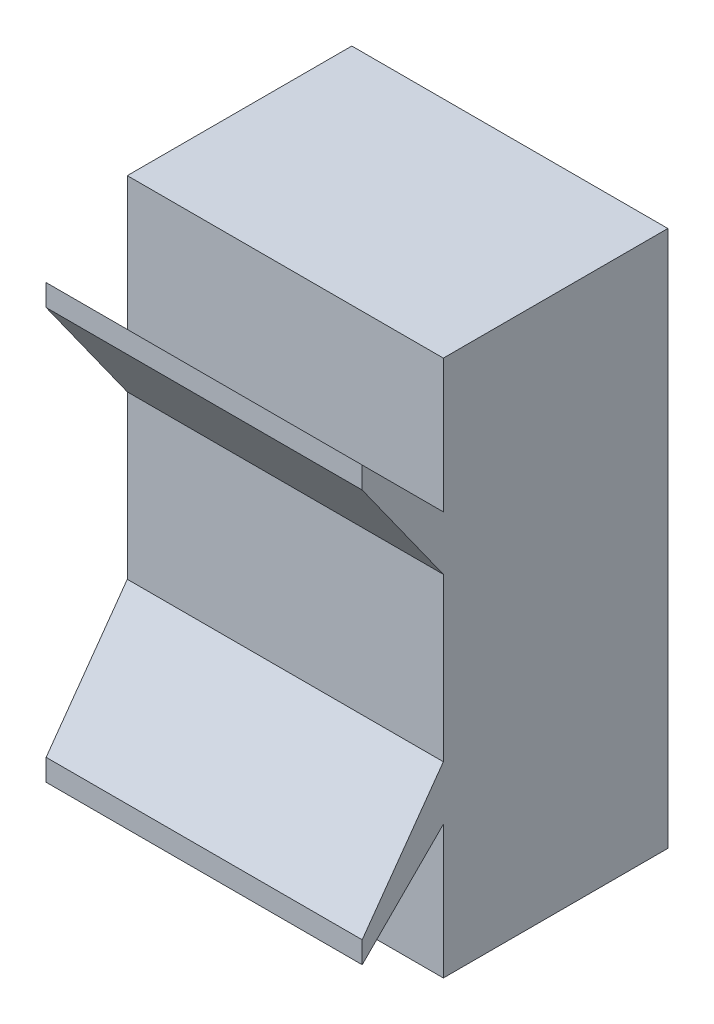
ISO-10303-21;
HEADER;
FILE_DESCRIPTION(('STEP AP214'),'2;1');
FILE_NAME('part.step','',(''),(''),'','','');
FILE_SCHEMA(('AUTOMOTIVE_DESIGN { 1 0 10303 214 1 1 1 1 }'));
ENDSEC;
DATA;
#1=APPLICATION_CONTEXT('core data for automotive mechanical design processes');
#2=APPLICATION_PROTOCOL_DEFINITION('international standard','automotive_design',2000,#1);
#3=PRODUCT_CONTEXT('',#1,'mechanical');
#4=PRODUCT('Part','Part','',(#3));
#5=PRODUCT_RELATED_PRODUCT_CATEGORY('part','',(#4));
#6=PRODUCT_DEFINITION_FORMATION('','',#4);
#7=PRODUCT_DEFINITION_CONTEXT('part definition',#1,'design');
#8=PRODUCT_DEFINITION('design','',#6,#7);
#9=PRODUCT_DEFINITION_SHAPE('','',#8);
#10=(LENGTH_UNIT() NAMED_UNIT(*) SI_UNIT(.MILLI.,.METRE.));
#11=(NAMED_UNIT(*) PLANE_ANGLE_UNIT() SI_UNIT($,.RADIAN.));
#12=(NAMED_UNIT(*) SI_UNIT($,.STERADIAN.) SOLID_ANGLE_UNIT());
#13=UNCERTAINTY_MEASURE_WITH_UNIT(LENGTH_MEASURE(1.E-05),#10,'distance_accuracy_value','');
#14=(GEOMETRIC_REPRESENTATION_CONTEXT(3) GLOBAL_UNCERTAINTY_ASSIGNED_CONTEXT((#13)) GLOBAL_UNIT_ASSIGNED_CONTEXT((#10,
#11,#12)) REPRESENTATION_CONTEXT('',''));
#15=CARTESIAN_POINT('',(0.,0.,0.));
#16=DIRECTION('',(0.,0.,1.));
#17=DIRECTION('',(1.,0.,0.));
#18=AXIS2_PLACEMENT_3D('',#15,#16,#17);
#19=CARTESIAN_POINT('',(-0.986425732328459,14.3199946452465,4.15));
#20=DIRECTION('',(0.,0.,1.));
#21=DIRECTION('',(1.,0.,0.));
#22=AXIS2_PLACEMENT_3D('',#19,#20,#21);
#23=PLANE('',#22);
#24=DIRECTION('',(1.,0.,0.));
#25=VECTOR('',#24,1.);
#26=CARTESIAN_POINT('',(5.97685012076511,27.8199946452465,4.15));
#27=LINE('',#26,#25);
#28=CARTESIAN_POINT('',(8.89232606818775,27.8199946452465,4.15));
#29=VERTEX_POINT('',#28);
#30=CARTESIAN_POINT('',(14.7348224671553,27.8199946452465,4.15));
#31=VERTEX_POINT('',#30);
#32=EDGE_CURVE('E55',#29,#31,#27,.T.);
#33=ORIENTED_EDGE('',*,*,#32,.F.);
#34=DIRECTION('',(0.,-1.,0.));
#35=VECTOR('',#34,1.);
#36=CARTESIAN_POINT('',(8.89232606818775,31.2817879589053,4.15));
#37=LINE('',#36,#35);
#38=CARTESIAN_POINT('',(8.89232606818776,24.8199946452465,4.15));
#39=VERTEX_POINT('',#38);
#40=EDGE_CURVE('E135',#29,#39,#37,.T.);
#41=ORIENTED_EDGE('',*,*,#40,.T.);
#42=DIRECTION('',(1.,0.,0.));
#43=VECTOR('',#42,1.);
#44=CARTESIAN_POINT('',(5.97685012076511,24.8199946452465,4.15));
#45=LINE('',#44,#43);
#46=CARTESIAN_POINT('',(14.7348224671553,24.8199946452465,4.15));
#47=VERTEX_POINT('',#46);
#48=EDGE_CURVE('E168',#39,#47,#45,.T.);
#49=ORIENTED_EDGE('',*,*,#48,.T.);
#50=DIRECTION('',(0.,1.,0.));
#51=VECTOR('',#50,1.);
#52=CARTESIAN_POINT('',(14.7348224671553,21.3582013315878,4.15));
#53=LINE('',#52,#51);
#54=EDGE_CURVE('E46',#47,#31,#53,.T.);
#55=ORIENTED_EDGE('',*,*,#54,.T.);
#56=EDGE_LOOP('',(#33,#41,#49,#55));
#57=FACE_BOUND('',#56,.T.);
#58=ADVANCED_FACE('F37',(#57),#23,.T.);
#59=DIRECTION('',(1.,0.,0.));
#60=VECTOR('',#59,1.);
#61=CARTESIAN_POINT('',(5.97685012076511,28.8199946452465,4.15));
#62=LINE('',#61,#60);
#63=CARTESIAN_POINT('',(8.89232606818775,28.8199946452465,4.15));
#64=VERTEX_POINT('',#63);
#65=CARTESIAN_POINT('',(14.7348224671553,28.8199946452465,4.15));
#66=VERTEX_POINT('',#65);
#67=EDGE_CURVE('E153',#64,#66,#62,.T.);
#68=ORIENTED_EDGE('',*,*,#67,.T.);
#69=CARTESIAN_POINT('',(14.7348224671553,31.2817879589053,4.15));
#70=VERTEX_POINT('',#69);
#71=EDGE_CURVE('E48',#66,#70,#53,.T.);
#72=ORIENTED_EDGE('',*,*,#71,.T.);
#73=DIRECTION('',(-1.,0.,0.));
#74=VECTOR('',#73,1.);
#75=CARTESIAN_POINT('',(14.7348224671553,31.2817879589053,4.15));
#76=LINE('',#75,#74);
#77=CARTESIAN_POINT('',(8.89232606818775,31.2817879589053,4.15));
#78=VERTEX_POINT('',#77);
#79=EDGE_CURVE('E191',#70,#78,#76,.T.);
#80=ORIENTED_EDGE('',*,*,#79,.T.);
#81=EDGE_CURVE('E63',#78,#64,#37,.T.);
#82=ORIENTED_EDGE('',*,*,#81,.T.);
#83=EDGE_LOOP('',(#68,#72,#80,#82));
#84=FACE_BOUND('',#83,.T.);
#85=ADVANCED_FACE('F227',(#84),#23,.T.);
#86=CARTESIAN_POINT('',(8.89232606818775,31.2817879589053,16.1657429513611));
#87=DIRECTION('',(1.,0.,0.));
#88=DIRECTION('',(0.,1.,0.));
#89=AXIS2_PLACEMENT_3D('',#86,#87,#88);
#90=PLANE('',#89);
#91=ORIENTED_EDGE('',*,*,#81,.F.);
#92=DIRECTION('',(0.,0.,-1.));
#93=VECTOR('',#92,1.);
#94=CARTESIAN_POINT('',(8.89232606818775,31.2817879589053,16.1657429513611));
#95=LINE('',#94,#93);
#96=CARTESIAN_POINT('',(8.89232606818775,31.2817879589053,0.));
#97=VERTEX_POINT('',#96);
#98=EDGE_CURVE('E41',#78,#97,#95,.T.);
#99=ORIENTED_EDGE('',*,*,#98,.T.);
#100=DIRECTION('',(0.,-1.,0.));
#101=VECTOR('',#100,1.);
#102=CARTESIAN_POINT('',(8.89232606818775,31.2817879589053,0.));
#103=LINE('',#102,#101);
#104=CARTESIAN_POINT('',(8.89232606818776,21.3582013315878,0.));
#105=VERTEX_POINT('',#104);
#106=EDGE_CURVE('E201',#97,#105,#103,.T.);
#107=ORIENTED_EDGE('',*,*,#106,.T.);
#108=DIRECTION('',(0.,0.,-1.));
#109=VECTOR('',#108,1.);
#110=CARTESIAN_POINT('',(8.89232606818776,21.3582013315878,16.1657429513611));
#111=LINE('',#110,#109);
#112=CARTESIAN_POINT('',(8.89232606818776,21.3582013315878,4.15));
#113=VERTEX_POINT('',#112);
#114=EDGE_CURVE('E200',#113,#105,#111,.T.);
#115=ORIENTED_EDGE('',*,*,#114,.F.);
#116=CARTESIAN_POINT('',(8.89232606818776,23.8199946452465,4.15));
#117=VERTEX_POINT('',#116);
#118=EDGE_CURVE('E208',#117,#113,#37,.T.);
#119=ORIENTED_EDGE('',*,*,#118,.F.);
#120=DIRECTION('',(0.,-0.707106781186547,0.707106781186549));
#121=VECTOR('',#120,1.);
#122=CARTESIAN_POINT('',(8.89232606818776,22.3199946452465,5.65));
#123=LINE('',#122,#121);
#124=CARTESIAN_POINT('',(8.89232606818776,22.3199946452465,5.65));
#125=VERTEX_POINT('',#124);
#126=EDGE_CURVE('E165',#117,#125,#123,.T.);
#127=ORIENTED_EDGE('',*,*,#126,.T.);
#128=DIRECTION('',(0.,1.,0.));
#129=VECTOR('',#128,1.);
#130=CARTESIAN_POINT('',(8.89232606818776,22.7199946452465,5.65));
#131=LINE('',#130,#129);
#132=CARTESIAN_POINT('',(8.89232606818776,22.7199946452465,5.65));
#133=VERTEX_POINT('',#132);
#134=EDGE_CURVE('E170',#125,#133,#131,.T.);
#135=ORIENTED_EDGE('',*,*,#134,.T.);
#136=DIRECTION('',(0.,0.813733471206735,-0.581238193719097));
#137=VECTOR('',#136,1.);
#138=CARTESIAN_POINT('',(8.89232606818776,24.8199946452465,4.15));
#139=LINE('',#138,#137);
#140=EDGE_CURVE('E167',#133,#39,#139,.T.);
#141=ORIENTED_EDGE('',*,*,#140,.T.);
#142=ORIENTED_EDGE('',*,*,#40,.F.);
#143=DIRECTION('',(0.,0.813733471206735,0.581238193719097));
#144=VECTOR('',#143,1.);
#145=CARTESIAN_POINT('',(8.89232606818775,27.8199946452465,4.15));
#146=LINE('',#145,#144);
#147=CARTESIAN_POINT('',(8.89232606818775,29.9199946452465,5.65));
#148=VERTEX_POINT('',#147);
#149=EDGE_CURVE('E129',#29,#148,#146,.T.);
#150=ORIENTED_EDGE('',*,*,#149,.T.);
#151=DIRECTION('',(0.,1.,0.));
#152=VECTOR('',#151,1.);
#153=CARTESIAN_POINT('',(8.89232606818775,29.9199946452465,5.65));
#154=LINE('',#153,#152);
#155=CARTESIAN_POINT('',(8.89232606818775,30.3199946452465,5.65));
#156=VERTEX_POINT('',#155);
#157=EDGE_CURVE('E132',#148,#156,#154,.T.);
#158=ORIENTED_EDGE('',*,*,#157,.T.);
#159=DIRECTION('',(0.,-0.707106781186547,-0.707106781186549));
#160=VECTOR('',#159,1.);
#161=CARTESIAN_POINT('',(8.89232606818775,30.3199946452465,5.65));
#162=LINE('',#161,#160);
#163=EDGE_CURVE('E146',#156,#64,#162,.T.);
#164=ORIENTED_EDGE('',*,*,#163,.T.);
#165=EDGE_LOOP('',(#91,#99,#107,#115,#119,#127,#135,#141,#142,#150,#158,#164));
#166=FACE_BOUND('',#165,.T.);
#167=ADVANCED_FACE('F131',(#166),#90,.F.);
#168=CARTESIAN_POINT('',(8.89232606818776,21.3582013315878,16.1657429513611));
#169=DIRECTION('',(0.,1.,0.));
#170=DIRECTION('',(0.,0.,1.));
#171=AXIS2_PLACEMENT_3D('',#168,#169,#170);
#172=PLANE('',#171);
#173=DIRECTION('',(1.,0.,0.));
#174=VECTOR('',#173,1.);
#175=CARTESIAN_POINT('',(8.89232606818776,21.3582013315878,4.15));
#176=LINE('',#175,#174);
#177=CARTESIAN_POINT('',(14.7348224671553,21.3582013315878,4.15));
#178=VERTEX_POINT('',#177);
#179=EDGE_CURVE('E204',#113,#178,#176,.T.);
#180=ORIENTED_EDGE('',*,*,#179,.F.);
#181=ORIENTED_EDGE('',*,*,#114,.T.);
#182=DIRECTION('',(1.,0.,0.));
#183=VECTOR('',#182,1.);
#184=CARTESIAN_POINT('',(8.89232606818776,21.3582013315878,0.));
#185=LINE('',#184,#183);
#186=CARTESIAN_POINT('',(14.7348224671553,21.3582013315878,0.));
#187=VERTEX_POINT('',#186);
#188=EDGE_CURVE('E197',#105,#187,#185,.T.);
#189=ORIENTED_EDGE('',*,*,#188,.T.);
#190=DIRECTION('',(0.,0.,-1.));
#191=VECTOR('',#190,1.);
#192=CARTESIAN_POINT('',(14.7348224671553,21.3582013315878,16.1657429513611));
#193=LINE('',#192,#191);
#194=EDGE_CURVE('E196',#178,#187,#193,.T.);
#195=ORIENTED_EDGE('',*,*,#194,.F.);
#196=EDGE_LOOP('',(#180,#181,#189,#195));
#197=FACE_BOUND('',#196,.T.);
#198=ADVANCED_FACE('F269',(#197),#172,.F.);
#199=CARTESIAN_POINT('',(14.7348224671553,21.3582013315878,16.1657429513611));
#200=DIRECTION('',(-1.,0.,0.));
#201=DIRECTION('',(0.,0.,1.));
#202=AXIS2_PLACEMENT_3D('',#199,#200,#201);
#203=PLANE('',#202);
#204=CARTESIAN_POINT('',(14.7348224671553,23.8199946452465,4.15));
#205=VERTEX_POINT('',#204);
#206=EDGE_CURVE('E12',#178,#205,#53,.T.);
#207=ORIENTED_EDGE('',*,*,#206,.F.);
#208=ORIENTED_EDGE('',*,*,#194,.T.);
#209=DIRECTION('',(0.,1.,0.));
#210=VECTOR('',#209,1.);
#211=CARTESIAN_POINT('',(14.7348224671553,21.3582013315878,0.));
#212=LINE('',#211,#210);
#213=CARTESIAN_POINT('',(14.7348224671553,31.2817879589053,0.));
#214=VERTEX_POINT('',#213);
#215=EDGE_CURVE('E193',#187,#214,#212,.T.);
#216=ORIENTED_EDGE('',*,*,#215,.T.);
#217=DIRECTION('',(0.,0.,-1.));
#218=VECTOR('',#217,1.);
#219=CARTESIAN_POINT('',(14.7348224671553,31.2817879589053,16.1657429513611));
#220=LINE('',#219,#218);
#221=EDGE_CURVE('E192',#70,#214,#220,.T.);
#222=ORIENTED_EDGE('',*,*,#221,.F.);
#223=ORIENTED_EDGE('',*,*,#71,.F.);
#224=DIRECTION('',(0.,0.707106781186547,0.707106781186549));
#225=VECTOR('',#224,1.);
#226=CARTESIAN_POINT('',(14.7348224671553,30.3199946452465,5.65));
#227=LINE('',#226,#225);
#228=CARTESIAN_POINT('',(14.7348224671553,30.3199946452465,5.65));
#229=VERTEX_POINT('',#228);
#230=EDGE_CURVE('E160',#66,#229,#227,.T.);
#231=ORIENTED_EDGE('',*,*,#230,.T.);
#232=DIRECTION('',(0.,-1.,0.));
#233=VECTOR('',#232,1.);
#234=CARTESIAN_POINT('',(14.7348224671553,29.9199946452465,5.65));
#235=LINE('',#234,#233);
#236=CARTESIAN_POINT('',(14.7348224671553,29.9199946452465,5.65));
#237=VERTEX_POINT('',#236);
#238=EDGE_CURVE('E158',#229,#237,#235,.T.);
#239=ORIENTED_EDGE('',*,*,#238,.T.);
#240=DIRECTION('',(0.,-0.813733471206735,-0.581238193719097));
#241=VECTOR('',#240,1.);
#242=CARTESIAN_POINT('',(14.7348224671553,27.8199946452465,4.15));
#243=LINE('',#242,#241);
#244=EDGE_CURVE('E150',#237,#31,#243,.T.);
#245=ORIENTED_EDGE('',*,*,#244,.T.);
#246=ORIENTED_EDGE('',*,*,#54,.F.);
#247=DIRECTION('',(0.,-0.813733471206735,0.581238193719097));
#248=VECTOR('',#247,1.);
#249=CARTESIAN_POINT('',(14.7348224671553,24.8199946452465,4.15));
#250=LINE('',#249,#248);
#251=CARTESIAN_POINT('',(14.7348224671553,22.7199946452465,5.65));
#252=VERTEX_POINT('',#251);
#253=EDGE_CURVE('E163',#47,#252,#250,.T.);
#254=ORIENTED_EDGE('',*,*,#253,.T.);
#255=DIRECTION('',(0.,-1.,0.));
#256=VECTOR('',#255,1.);
#257=CARTESIAN_POINT('',(14.7348224671553,22.7199946452465,5.65));
#258=LINE('',#257,#256);
#259=CARTESIAN_POINT('',(14.7348224671553,22.3199946452465,5.65));
#260=VERTEX_POINT('',#259);
#261=EDGE_CURVE('E173',#252,#260,#258,.T.);
#262=ORIENTED_EDGE('',*,*,#261,.T.);
#263=DIRECTION('',(0.,0.707106781186547,-0.707106781186549));
#264=VECTOR('',#263,1.);
#265=CARTESIAN_POINT('',(14.7348224671553,22.3199946452465,5.65));
#266=LINE('',#265,#264);
#267=EDGE_CURVE('E176',#260,#205,#266,.T.);
#268=ORIENTED_EDGE('',*,*,#267,.T.);
#269=EDGE_LOOP('',(#207,#208,#216,#222,#223,#231,#239,#245,#246,#254,#262,#268));
#270=FACE_BOUND('',#269,.T.);
#271=ADVANCED_FACE('F219',(#270),#203,.F.);
#272=CARTESIAN_POINT('',(14.7348224671553,31.2817879589053,16.1657429513611));
#273=DIRECTION('',(0.,-1.,0.));
#274=DIRECTION('',(0.,0.,-1.));
#275=AXIS2_PLACEMENT_3D('',#272,#273,#274);
#276=PLANE('',#275);
#277=ORIENTED_EDGE('',*,*,#79,.F.);
#278=ORIENTED_EDGE('',*,*,#221,.T.);
#279=DIRECTION('',(-1.,0.,0.));
#280=VECTOR('',#279,1.);
#281=CARTESIAN_POINT('',(14.7348224671553,31.2817879589053,0.));
#282=LINE('',#281,#280);
#283=EDGE_CURVE('E188',#214,#97,#282,.T.);
#284=ORIENTED_EDGE('',*,*,#283,.T.);
#285=ORIENTED_EDGE('',*,*,#98,.F.);
#286=EDGE_LOOP('',(#277,#278,#284,#285));
#287=FACE_BOUND('',#286,.T.);
#288=ADVANCED_FACE('F214',(#287),#276,.F.);
#289=CARTESIAN_POINT('',(0.,0.,0.));
#290=DIRECTION('',(0.,0.,1.));
#291=DIRECTION('',(1.,0.,0.));
#292=AXIS2_PLACEMENT_3D('',#289,#290,#291);
#293=PLANE('',#292);
#294=ORIENTED_EDGE('',*,*,#106,.F.);
#295=ORIENTED_EDGE('',*,*,#283,.F.);
#296=ORIENTED_EDGE('',*,*,#215,.F.);
#297=ORIENTED_EDGE('',*,*,#188,.F.);
#298=EDGE_LOOP('',(#294,#295,#296,#297));
#299=FACE_BOUND('',#298,.T.);
#300=ADVANCED_FACE('F223',(#299),#293,.F.);
#301=DIRECTION('',(1.,0.,0.));
#302=VECTOR('',#301,1.);
#303=CARTESIAN_POINT('',(5.97685012076511,23.8199946452465,4.15));
#304=LINE('',#303,#302);
#305=EDGE_CURVE('E181',#117,#205,#304,.T.);
#306=ORIENTED_EDGE('',*,*,#305,.F.);
#307=ORIENTED_EDGE('',*,*,#118,.T.);
#308=ORIENTED_EDGE('',*,*,#179,.T.);
#309=ORIENTED_EDGE('',*,*,#206,.T.);
#310=EDGE_LOOP('',(#306,#307,#308,#309));
#311=FACE_BOUND('',#310,.T.);
#312=ADVANCED_FACE('F39',(#311),#23,.T.);
#313=CARTESIAN_POINT('',(5.97685012076511,24.8199946452465,4.15));
#314=DIRECTION('',(0.,0.581238193719097,0.813733471206734));
#315=DIRECTION('',(0.,-0.813733471206735,0.581238193719097));
#316=AXIS2_PLACEMENT_3D('',#313,#314,#315);
#317=PLANE('',#316);
#318=ORIENTED_EDGE('',*,*,#140,.F.);
#319=DIRECTION('',(1.,0.,0.));
#320=VECTOR('',#319,1.);
#321=CARTESIAN_POINT('',(5.97685012076511,22.7199946452465,5.65));
#322=LINE('',#321,#320);
#323=EDGE_CURVE('E179',#133,#252,#322,.T.);
#324=ORIENTED_EDGE('',*,*,#323,.T.);
#325=ORIENTED_EDGE('',*,*,#253,.F.);
#326=ORIENTED_EDGE('',*,*,#48,.F.);
#327=EDGE_LOOP('',(#318,#324,#325,#326));
#328=FACE_BOUND('',#327,.T.);
#329=ADVANCED_FACE('F247',(#328),#317,.T.);
#330=CARTESIAN_POINT('',(5.97685012076511,22.3199946452465,5.65));
#331=DIRECTION('',(0.,-0.707106781186549,-0.707106781186547));
#332=DIRECTION('',(0.,0.707106781186547,-0.707106781186549));
#333=AXIS2_PLACEMENT_3D('',#330,#331,#332);
#334=PLANE('',#333);
#335=ORIENTED_EDGE('',*,*,#126,.F.);
#336=ORIENTED_EDGE('',*,*,#305,.T.);
#337=ORIENTED_EDGE('',*,*,#267,.F.);
#338=DIRECTION('',(1.,0.,0.));
#339=VECTOR('',#338,1.);
#340=CARTESIAN_POINT('',(5.97685012076511,22.3199946452465,5.65));
#341=LINE('',#340,#339);
#342=EDGE_CURVE('E184',#125,#260,#341,.T.);
#343=ORIENTED_EDGE('',*,*,#342,.F.);
#344=EDGE_LOOP('',(#335,#336,#337,#343));
#345=FACE_BOUND('',#344,.T.);
#346=ADVANCED_FACE('F253',(#345),#334,.T.);
#347=CARTESIAN_POINT('',(5.97685012076511,22.7199946452465,5.65));
#348=DIRECTION('',(0.,0.,1.));
#349=DIRECTION('',(1.,0.,0.));
#350=AXIS2_PLACEMENT_3D('',#347,#348,#349);
#351=PLANE('',#350);
#352=ORIENTED_EDGE('',*,*,#134,.F.);
#353=ORIENTED_EDGE('',*,*,#342,.T.);
#354=ORIENTED_EDGE('',*,*,#261,.F.);
#355=ORIENTED_EDGE('',*,*,#323,.F.);
#356=EDGE_LOOP('',(#352,#353,#354,#355));
#357=FACE_BOUND('',#356,.T.);
#358=ADVANCED_FACE('F266',(#357),#351,.T.);
#359=CARTESIAN_POINT('',(5.97685012076511,27.8199946452465,4.15));
#360=DIRECTION('',(0.,-0.581238193719097,0.813733471206734));
#361=DIRECTION('',(0.,-0.813733471206735,-0.581238193719097));
#362=AXIS2_PLACEMENT_3D('',#359,#360,#361);
#363=PLANE('',#362);
#364=ORIENTED_EDGE('',*,*,#149,.F.);
#365=ORIENTED_EDGE('',*,*,#32,.T.);
#366=ORIENTED_EDGE('',*,*,#244,.F.);
#367=DIRECTION('',(1.,0.,0.));
#368=VECTOR('',#367,1.);
#369=CARTESIAN_POINT('',(5.97685012076511,29.9199946452465,5.65));
#370=LINE('',#369,#368);
#371=EDGE_CURVE('E143',#148,#237,#370,.T.);
#372=ORIENTED_EDGE('',*,*,#371,.F.);
#373=EDGE_LOOP('',(#364,#365,#366,#372));
#374=FACE_BOUND('',#373,.T.);
#375=ADVANCED_FACE('F148',(#374),#363,.T.);
#376=CARTESIAN_POINT('',(5.97685012076511,29.9199946452465,5.65));
#377=DIRECTION('',(0.,0.,1.));
#378=DIRECTION('',(1.,0.,0.));
#379=AXIS2_PLACEMENT_3D('',#376,#377,#378);
#380=PLANE('',#379);
#381=ORIENTED_EDGE('',*,*,#157,.F.);
#382=ORIENTED_EDGE('',*,*,#371,.T.);
#383=ORIENTED_EDGE('',*,*,#238,.F.);
#384=DIRECTION('',(1.,0.,0.));
#385=VECTOR('',#384,1.);
#386=CARTESIAN_POINT('',(5.97685012076511,30.3199946452465,5.65));
#387=LINE('',#386,#385);
#388=EDGE_CURVE('E145',#156,#229,#387,.T.);
#389=ORIENTED_EDGE('',*,*,#388,.F.);
#390=EDGE_LOOP('',(#381,#382,#383,#389));
#391=FACE_BOUND('',#390,.T.);
#392=ADVANCED_FACE('F141',(#391),#380,.T.);
#393=CARTESIAN_POINT('',(5.97685012076511,30.3199946452465,5.65));
#394=DIRECTION('',(0.,0.707106781186549,-0.707106781186547));
#395=DIRECTION('',(0.,0.707106781186547,0.707106781186549));
#396=AXIS2_PLACEMENT_3D('',#393,#394,#395);
#397=PLANE('',#396);
#398=ORIENTED_EDGE('',*,*,#163,.F.);
#399=ORIENTED_EDGE('',*,*,#388,.T.);
#400=ORIENTED_EDGE('',*,*,#230,.F.);
#401=ORIENTED_EDGE('',*,*,#67,.F.);
#402=EDGE_LOOP('',(#398,#399,#400,#401));
#403=FACE_BOUND('',#402,.T.);
#404=ADVANCED_FACE('F234',(#403),#397,.T.);
#405=CLOSED_SHELL('',(#58,#85,#167,#198,#271,#288,#300,#312,#329,#346,#358,#375,#392,#404));
#406=MANIFOLD_SOLID_BREP('B2',#405);
#407=ADVANCED_BREP_SHAPE_REPRESENTATION('',(#18,#406),#14);
#408=SHAPE_DEFINITION_REPRESENTATION(#9,#407);
ENDSEC;
END-ISO-10303-21;
